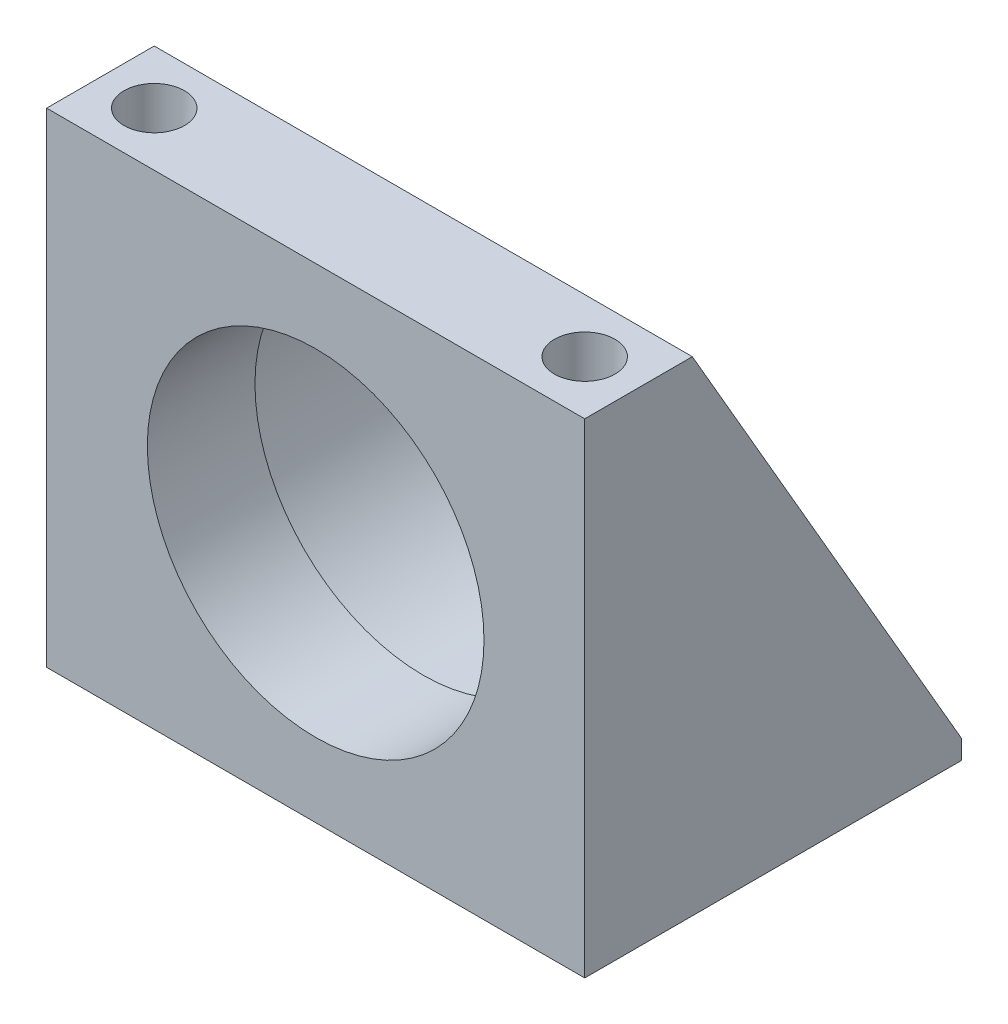
ISO-10303-21;
HEADER;
FILE_DESCRIPTION(('STEP AP214'),'2;1');
FILE_NAME('part.step','',(''),(''),'','','');
FILE_SCHEMA(('AUTOMOTIVE_DESIGN { 1 0 10303 214 1 1 1 1 }'));
ENDSEC;
DATA;
#1=APPLICATION_CONTEXT('core data for automotive mechanical design processes');
#2=APPLICATION_PROTOCOL_DEFINITION('international standard','automotive_design',2000,#1);
#3=PRODUCT_CONTEXT('',#1,'mechanical');
#4=PRODUCT('Part','Part','',(#3));
#5=PRODUCT_RELATED_PRODUCT_CATEGORY('part','',(#4));
#6=PRODUCT_DEFINITION_FORMATION('','',#4);
#7=PRODUCT_DEFINITION_CONTEXT('part definition',#1,'design');
#8=PRODUCT_DEFINITION('design','',#6,#7);
#9=PRODUCT_DEFINITION_SHAPE('','',#8);
#10=(LENGTH_UNIT() NAMED_UNIT(*) SI_UNIT(.MILLI.,.METRE.));
#11=(NAMED_UNIT(*) PLANE_ANGLE_UNIT() SI_UNIT($,.RADIAN.));
#12=(NAMED_UNIT(*) SI_UNIT($,.STERADIAN.) SOLID_ANGLE_UNIT());
#13=UNCERTAINTY_MEASURE_WITH_UNIT(LENGTH_MEASURE(1.E-05),#10,'distance_accuracy_value','');
#14=(GEOMETRIC_REPRESENTATION_CONTEXT(3) GLOBAL_UNCERTAINTY_ASSIGNED_CONTEXT((#13)) GLOBAL_UNIT_ASSIGNED_CONTEXT((#10,
#11,#12)) REPRESENTATION_CONTEXT('',''));
#15=CARTESIAN_POINT('',(0.,0.,0.));
#16=DIRECTION('',(0.,0.,1.));
#17=DIRECTION('',(1.,0.,0.));
#18=AXIS2_PLACEMENT_3D('',#15,#16,#17);
#19=CARTESIAN_POINT('',(-31.75,57.15,-44.45));
#20=DIRECTION('',(-1.,0.,0.));
#21=DIRECTION('',(0.,-1.,0.));
#22=AXIS2_PLACEMENT_3D('',#19,#20,#21);
#23=PLANE('',#22);
#24=DIRECTION('',(0.,-0.865517717728897,-0.500878308870889));
#25=VECTOR('',#24,1.);
#26=CARTESIAN_POINT('',(-31.75,57.15,-12.7));
#27=LINE('',#26,#25);
#28=CARTESIAN_POINT('',(-31.75,57.15,-12.7));
#29=VERTEX_POINT('',#28);
#30=CARTESIAN_POINT('',(-31.75,2.28600000000001,-44.45));
#31=VERTEX_POINT('',#30);
#32=EDGE_CURVE('E191',#29,#31,#27,.T.);
#33=ORIENTED_EDGE('',*,*,#32,.T.);
#34=DIRECTION('',(0.,-1.,0.));
#35=VECTOR('',#34,1.);
#36=CARTESIAN_POINT('',(-31.75,57.15,-44.45));
#37=LINE('',#36,#35);
#38=CARTESIAN_POINT('',(-31.75,0.,-44.45));
#39=VERTEX_POINT('',#38);
#40=EDGE_CURVE('E104',#31,#39,#37,.T.);
#41=ORIENTED_EDGE('',*,*,#40,.T.);
#42=DIRECTION('',(0.,0.,1.));
#43=VECTOR('',#42,1.);
#44=CARTESIAN_POINT('',(-31.75,0.,-44.45));
#45=LINE('',#44,#43);
#46=CARTESIAN_POINT('',(-31.75,0.,0.));
#47=VERTEX_POINT('',#46);
#48=EDGE_CURVE('E94',#39,#47,#45,.T.);
#49=ORIENTED_EDGE('',*,*,#48,.T.);
#50=DIRECTION('',(0.,-1.,0.));
#51=VECTOR('',#50,1.);
#52=CARTESIAN_POINT('',(-31.75,57.15,0.));
#53=LINE('',#52,#51);
#54=CARTESIAN_POINT('',(-31.75,57.15,0.));
#55=VERTEX_POINT('',#54);
#56=EDGE_CURVE('E92',#55,#47,#53,.T.);
#57=ORIENTED_EDGE('',*,*,#56,.F.);
#58=DIRECTION('',(0.,0.,1.));
#59=VECTOR('',#58,1.);
#60=CARTESIAN_POINT('',(-31.75,57.15,-44.45));
#61=LINE('',#60,#59);
#62=EDGE_CURVE('E79',#29,#55,#61,.T.);
#63=ORIENTED_EDGE('',*,*,#62,.F.);
#64=EDGE_LOOP('',(#33,#41,#49,#57,#63));
#65=FACE_BOUND('',#64,.T.);
#66=ADVANCED_FACE('F35',(#65),#23,.T.);
#67=CARTESIAN_POINT('',(-31.75,57.15,-44.45));
#68=DIRECTION('',(0.,1.,0.));
#69=DIRECTION('',(0.,0.,1.));
#70=AXIS2_PLACEMENT_3D('',#67,#68,#69);
#71=PLANE('',#70);
#72=CARTESIAN_POINT('',(-25.4,57.15,-6.35));
#73=DIRECTION('',(0.,1.,0.));
#74=DIRECTION('',(0.,0.,1.));
#75=AXIS2_PLACEMENT_3D('',#72,#73,#74);
#76=CIRCLE('',#75,3.56870000000001);
#77=CARTESIAN_POINT('',(-25.4,57.15,-2.78129999999998));
#78=VERTEX_POINT('',#77);
#79=EDGE_CURVE('E179',#78,#78,#76,.T.);
#80=ORIENTED_EDGE('',*,*,#79,.F.);
#81=EDGE_LOOP('',(#80));
#82=FACE_BOUND('',#81,.T.);
#83=CARTESIAN_POINT('',(25.4,57.15,-6.35));
#84=DIRECTION('',(0.,1.,0.));
#85=DIRECTION('',(0.,0.,1.));
#86=AXIS2_PLACEMENT_3D('',#83,#84,#85);
#87=CIRCLE('',#86,3.56870000000001);
#88=CARTESIAN_POINT('',(25.4,57.15,-2.78129999999998));
#89=VERTEX_POINT('',#88);
#90=EDGE_CURVE('E183',#89,#89,#87,.T.);
#91=ORIENTED_EDGE('',*,*,#90,.F.);
#92=EDGE_LOOP('',(#91));
#93=FACE_BOUND('',#92,.T.);
#94=DIRECTION('',(1.,0.,0.));
#95=VECTOR('',#94,1.);
#96=CARTESIAN_POINT('',(-31.75,57.15,-12.7));
#97=LINE('',#96,#95);
#98=CARTESIAN_POINT('',(31.75,57.15,-12.7));
#99=VERTEX_POINT('',#98);
#100=EDGE_CURVE('E86',#29,#99,#97,.T.);
#101=ORIENTED_EDGE('',*,*,#100,.F.);
#102=ORIENTED_EDGE('',*,*,#62,.T.);
#103=DIRECTION('',(-1.,0.,0.));
#104=VECTOR('',#103,1.);
#105=CARTESIAN_POINT('',(-31.75,57.15,0.));
#106=LINE('',#105,#104);
#107=CARTESIAN_POINT('',(31.75,57.15,0.));
#108=VERTEX_POINT('',#107);
#109=EDGE_CURVE('E84',#108,#55,#106,.T.);
#110=ORIENTED_EDGE('',*,*,#109,.F.);
#111=DIRECTION('',(0.,0.,1.));
#112=VECTOR('',#111,1.);
#113=CARTESIAN_POINT('',(31.75,57.15,-44.45));
#114=LINE('',#113,#112);
#115=EDGE_CURVE('E89',#99,#108,#114,.T.);
#116=ORIENTED_EDGE('',*,*,#115,.F.);
#117=EDGE_LOOP('',(#101,#102,#110,#116));
#118=FACE_BOUND('',#117,.T.);
#119=ADVANCED_FACE('F81',(#82,#93,#118),#71,.T.);
#120=CARTESIAN_POINT('',(31.75,57.15,-44.45));
#121=DIRECTION('',(1.,0.,0.));
#122=DIRECTION('',(0.,1.,0.));
#123=AXIS2_PLACEMENT_3D('',#120,#121,#122);
#124=PLANE('',#123);
#125=DIRECTION('',(0.,-0.865517717728897,-0.500878308870889));
#126=VECTOR('',#125,1.);
#127=CARTESIAN_POINT('',(31.75,57.15,-12.7));
#128=LINE('',#127,#126);
#129=CARTESIAN_POINT('',(31.75,2.286,-44.45));
#130=VERTEX_POINT('',#129);
#131=EDGE_CURVE('E50',#99,#130,#128,.T.);
#132=ORIENTED_EDGE('',*,*,#131,.F.);
#133=ORIENTED_EDGE('',*,*,#115,.T.);
#134=DIRECTION('',(0.,1.,0.));
#135=VECTOR('',#134,1.);
#136=CARTESIAN_POINT('',(31.75,57.15,0.));
#137=LINE('',#136,#135);
#138=CARTESIAN_POINT('',(31.75,0.,0.));
#139=VERTEX_POINT('',#138);
#140=EDGE_CURVE('E103',#139,#108,#137,.T.);
#141=ORIENTED_EDGE('',*,*,#140,.F.);
#142=DIRECTION('',(0.,0.,1.));
#143=VECTOR('',#142,1.);
#144=CARTESIAN_POINT('',(31.75,0.,-44.45));
#145=LINE('',#144,#143);
#146=CARTESIAN_POINT('',(31.75,0.,-44.45));
#147=VERTEX_POINT('',#146);
#148=EDGE_CURVE('E59',#147,#139,#145,.T.);
#149=ORIENTED_EDGE('',*,*,#148,.F.);
#150=DIRECTION('',(0.,1.,0.));
#151=VECTOR('',#150,1.);
#152=CARTESIAN_POINT('',(31.75,57.15,-44.45));
#153=LINE('',#152,#151);
#154=EDGE_CURVE('E114',#147,#130,#153,.T.);
#155=ORIENTED_EDGE('',*,*,#154,.T.);
#156=EDGE_LOOP('',(#132,#133,#141,#149,#155));
#157=FACE_BOUND('',#156,.T.);
#158=ADVANCED_FACE('F145',(#157),#124,.T.);
#159=CARTESIAN_POINT('',(-31.75,0.,-44.45));
#160=DIRECTION('',(0.,-1.,0.));
#161=DIRECTION('',(0.,0.,-1.));
#162=AXIS2_PLACEMENT_3D('',#159,#160,#161);
#163=PLANE('',#162);
#164=CARTESIAN_POINT('',(-25.4,0.,-6.35));
#165=DIRECTION('',(0.,-1.,0.));
#166=DIRECTION('',(0.,0.,-1.));
#167=AXIS2_PLACEMENT_3D('',#164,#165,#166);
#168=CIRCLE('',#167,3.56870000000001);
#169=CARTESIAN_POINT('',(-25.4,0.,-9.91870000000001));
#170=VERTEX_POINT('',#169);
#171=EDGE_CURVE('E182',#170,#170,#168,.T.);
#172=ORIENTED_EDGE('',*,*,#171,.F.);
#173=EDGE_LOOP('',(#172));
#174=FACE_BOUND('',#173,.T.);
#175=CARTESIAN_POINT('',(25.4,0.,-6.35));
#176=DIRECTION('',(0.,-1.,0.));
#177=DIRECTION('',(0.,0.,-1.));
#178=AXIS2_PLACEMENT_3D('',#175,#176,#177);
#179=CIRCLE('',#178,3.56870000000001);
#180=CARTESIAN_POINT('',(25.4,0.,-9.91870000000001));
#181=VERTEX_POINT('',#180);
#182=EDGE_CURVE('E119',#181,#181,#179,.T.);
#183=ORIENTED_EDGE('',*,*,#182,.F.);
#184=EDGE_LOOP('',(#183));
#185=FACE_BOUND('',#184,.T.);
#186=DIRECTION('',(1.,0.,0.));
#187=VECTOR('',#186,1.);
#188=CARTESIAN_POINT('',(-31.75,0.,0.));
#189=LINE('',#188,#187);
#190=EDGE_CURVE('E98',#47,#139,#189,.T.);
#191=ORIENTED_EDGE('',*,*,#190,.F.);
#192=ORIENTED_EDGE('',*,*,#48,.F.);
#193=DIRECTION('',(1.,0.,0.));
#194=VECTOR('',#193,1.);
#195=CARTESIAN_POINT('',(-31.75,0.,-44.45));
#196=LINE('',#195,#194);
#197=EDGE_CURVE('E106',#39,#147,#196,.T.);
#198=ORIENTED_EDGE('',*,*,#197,.T.);
#199=ORIENTED_EDGE('',*,*,#148,.T.);
#200=EDGE_LOOP('',(#191,#192,#198,#199));
#201=FACE_BOUND('',#200,.T.);
#202=ADVANCED_FACE('F149',(#174,#185,#201),#163,.T.);
#203=CARTESIAN_POINT('',(-31.75,0.,-44.45));
#204=DIRECTION('',(0.,0.,1.));
#205=DIRECTION('',(1.,0.,0.));
#206=AXIS2_PLACEMENT_3D('',#203,#204,#205);
#207=PLANE('',#206);
#208=ORIENTED_EDGE('',*,*,#40,.F.);
#209=DIRECTION('',(1.,0.,0.));
#210=VECTOR('',#209,1.);
#211=CARTESIAN_POINT('',(-31.75,2.28600000000001,-44.45));
#212=LINE('',#211,#210);
#213=EDGE_CURVE('E194',#31,#130,#212,.T.);
#214=ORIENTED_EDGE('',*,*,#213,.T.);
#215=ORIENTED_EDGE('',*,*,#154,.F.);
#216=ORIENTED_EDGE('',*,*,#197,.F.);
#217=EDGE_LOOP('',(#208,#214,#215,#216));
#218=FACE_BOUND('',#217,.T.);
#219=ADVANCED_FACE('F152',(#218),#207,.F.);
#220=CARTESIAN_POINT('',(-31.75,0.,0.));
#221=DIRECTION('',(0.,0.,1.));
#222=DIRECTION('',(1.,0.,0.));
#223=AXIS2_PLACEMENT_3D('',#220,#221,#222);
#224=PLANE('',#223);
#225=CARTESIAN_POINT('',(0.,28.575,0.));
#226=DIRECTION('',(0.,0.,1.));
#227=DIRECTION('',(1.,0.,0.));
#228=AXIS2_PLACEMENT_3D('',#225,#226,#227);
#229=CIRCLE('',#228,19.8628);
#230=CARTESIAN_POINT('',(19.8628,28.575,0.));
#231=VERTEX_POINT('',#230);
#232=EDGE_CURVE('E99',#231,#231,#229,.T.);
#233=ORIENTED_EDGE('',*,*,#232,.F.);
#234=EDGE_LOOP('',(#233));
#235=FACE_BOUND('',#234,.T.);
#236=ORIENTED_EDGE('',*,*,#56,.T.);
#237=ORIENTED_EDGE('',*,*,#190,.T.);
#238=ORIENTED_EDGE('',*,*,#140,.T.);
#239=ORIENTED_EDGE('',*,*,#109,.T.);
#240=EDGE_LOOP('',(#236,#237,#238,#239));
#241=FACE_BOUND('',#240,.T.);
#242=ADVANCED_FACE('F102',(#235,#241),#224,.T.);
#243=CARTESIAN_POINT('',(0.,28.575,-44.45));
#244=DIRECTION('',(0.,0.,1.));
#245=DIRECTION('',(1.,0.,0.));
#246=AXIS2_PLACEMENT_3D('',#243,#244,#245);
#247=CYLINDRICAL_SURFACE('',#246,19.8628);
#248=CARTESIAN_POINT('',(0.,28.575,-12.7));
#249=DIRECTION('',(0.,0.,1.));
#250=DIRECTION('',(1.,0.,0.));
#251=AXIS2_PLACEMENT_3D('',#248,#249,#250);
#252=CIRCLE('',#251,19.8628);
#253=CARTESIAN_POINT('',(19.8628,28.575,-12.7));
#254=VERTEX_POINT('',#253);
#255=EDGE_CURVE('E118',#254,#254,#252,.F.);
#256=ORIENTED_EDGE('',*,*,#255,.T.);
#257=EDGE_LOOP('',(#256));
#258=FACE_BOUND('',#257,.T.);
#259=ORIENTED_EDGE('',*,*,#232,.T.);
#260=EDGE_LOOP('',(#259));
#261=FACE_BOUND('',#260,.T.);
#262=ADVANCED_FACE('F158',(#258,#261),#247,.F.);
#263=CARTESIAN_POINT('',(-31.75,57.15,-12.7));
#264=DIRECTION('',(0.,-0.500878308870889,0.865517717728897));
#265=DIRECTION('',(0.,-0.865517717728897,-0.500878308870889));
#266=AXIS2_PLACEMENT_3D('',#263,#264,#265);
#267=PLANE('',#266);
#268=CARTESIAN_POINT('',(0.,28.575,-29.2364583333333));
#269=DIRECTION('',(0.,-0.500878308870889,0.865517717728897));
#270=DIRECTION('',(0.,-0.865517717728897,-0.500878308870889));
#271=AXIS2_PLACEMENT_3D('',#268,#269,#270);
#272=ELLIPSE('',#271,25.6782727201911,22.225);
#273=CARTESIAN_POINT('',(0.,6.34999999999999,-42.0981481481482));
#274=VERTEX_POINT('',#273);
#275=EDGE_CURVE('E115',#274,#274,#272,.T.);
#276=ORIENTED_EDGE('',*,*,#275,.T.);
#277=EDGE_LOOP('',(#276));
#278=FACE_BOUND('',#277,.T.);
#279=ORIENTED_EDGE('',*,*,#131,.T.);
#280=ORIENTED_EDGE('',*,*,#213,.F.);
#281=ORIENTED_EDGE('',*,*,#32,.F.);
#282=ORIENTED_EDGE('',*,*,#100,.T.);
#283=EDGE_LOOP('',(#279,#280,#281,#282));
#284=FACE_BOUND('',#283,.T.);
#285=ADVANCED_FACE('F165',(#278,#284),#267,.F.);
#286=CARTESIAN_POINT('',(-31.75,0.,-12.7));
#287=DIRECTION('',(0.,0.,1.));
#288=DIRECTION('',(1.,0.,0.));
#289=AXIS2_PLACEMENT_3D('',#286,#287,#288);
#290=PLANE('',#289);
#291=CARTESIAN_POINT('',(0.,28.575,-12.7));
#292=DIRECTION('',(0.,0.,1.));
#293=DIRECTION('',(1.,0.,0.));
#294=AXIS2_PLACEMENT_3D('',#291,#292,#293);
#295=CIRCLE('',#294,20.701);
#296=CARTESIAN_POINT('',(20.701,28.575,-12.7));
#297=VERTEX_POINT('',#296);
#298=EDGE_CURVE('E43',#297,#297,#295,.F.);
#299=ORIENTED_EDGE('',*,*,#298,.T.);
#300=EDGE_LOOP('',(#299));
#301=FACE_BOUND('',#300,.T.);
#302=ORIENTED_EDGE('',*,*,#255,.F.);
#303=EDGE_LOOP('',(#302));
#304=FACE_BOUND('',#303,.T.);
#305=ADVANCED_FACE('F124',(#301,#304),#290,.F.);
#306=CARTESIAN_POINT('',(0.,28.575,62.8617928474841));
#307=DIRECTION('',(0.,0.,-1.));
#308=DIRECTION('',(-1.,0.,0.));
#309=AXIS2_PLACEMENT_3D('',#306,#307,#308);
#310=CYLINDRICAL_SURFACE('',#309,22.225);
#311=CARTESIAN_POINT('',(0.,28.575,-14.224));
#312=DIRECTION('',(0.,0.,1.));
#313=DIRECTION('',(1.,0.,0.));
#314=AXIS2_PLACEMENT_3D('',#311,#312,#313);
#315=CIRCLE('',#314,22.225);
#316=CARTESIAN_POINT('',(22.225,28.575,-14.224));
#317=VERTEX_POINT('',#316);
#318=EDGE_CURVE('E12',#317,#317,#315,.T.);
#319=ORIENTED_EDGE('',*,*,#318,.T.);
#320=EDGE_LOOP('',(#319));
#321=FACE_BOUND('',#320,.T.);
#322=ORIENTED_EDGE('',*,*,#275,.F.);
#323=EDGE_LOOP('',(#322));
#324=FACE_BOUND('',#323,.T.);
#325=ADVANCED_FACE('F129',(#321,#324),#310,.F.);
#326=CARTESIAN_POINT('',(0.,28.575,-14.224));
#327=DIRECTION('',(0.,0.,1.));
#328=DIRECTION('',(1.,0.,0.));
#329=AXIS2_PLACEMENT_3D('',#326,#327,#328);
#330=TOROIDAL_SURFACE('',#329,20.701,1.524);
#331=ORIENTED_EDGE('',*,*,#318,.F.);
#332=EDGE_LOOP('',(#331));
#333=FACE_BOUND('',#332,.T.);
#334=ORIENTED_EDGE('',*,*,#298,.F.);
#335=EDGE_LOOP('',(#334));
#336=FACE_BOUND('',#335,.T.);
#337=ADVANCED_FACE('F37',(#333,#336),#330,.F.);
#338=CARTESIAN_POINT('',(25.4,57.15,-6.35));
#339=DIRECTION('',(0.,1.,0.));
#340=DIRECTION('',(0.,0.,1.));
#341=AXIS2_PLACEMENT_3D('',#338,#339,#340);
#342=CYLINDRICAL_SURFACE('',#341,3.56870000000001);
#343=ORIENTED_EDGE('',*,*,#90,.T.);
#344=EDGE_LOOP('',(#343));
#345=FACE_BOUND('',#344,.T.);
#346=ORIENTED_EDGE('',*,*,#182,.T.);
#347=EDGE_LOOP('',(#346));
#348=FACE_BOUND('',#347,.T.);
#349=ADVANCED_FACE('F128',(#345,#348),#342,.F.);
#350=CARTESIAN_POINT('',(-25.4,57.15,-6.35));
#351=DIRECTION('',(0.,1.,0.));
#352=DIRECTION('',(0.,0.,1.));
#353=AXIS2_PLACEMENT_3D('',#350,#351,#352);
#354=CYLINDRICAL_SURFACE('',#353,3.56870000000001);
#355=ORIENTED_EDGE('',*,*,#79,.T.);
#356=EDGE_LOOP('',(#355));
#357=FACE_BOUND('',#356,.T.);
#358=ORIENTED_EDGE('',*,*,#171,.T.);
#359=EDGE_LOOP('',(#358));
#360=FACE_BOUND('',#359,.T.);
#361=ADVANCED_FACE('F135',(#357,#360),#354,.F.);
#362=CLOSED_SHELL('',(#66,#119,#158,#202,#219,#242,#262,#285,#305,#325,#337,#349,#361));
#363=MANIFOLD_SOLID_BREP('B2',#362);
#364=ADVANCED_BREP_SHAPE_REPRESENTATION('',(#18,#363),#14);
#365=SHAPE_DEFINITION_REPRESENTATION(#9,#364);
ENDSEC;
END-ISO-10303-21;
